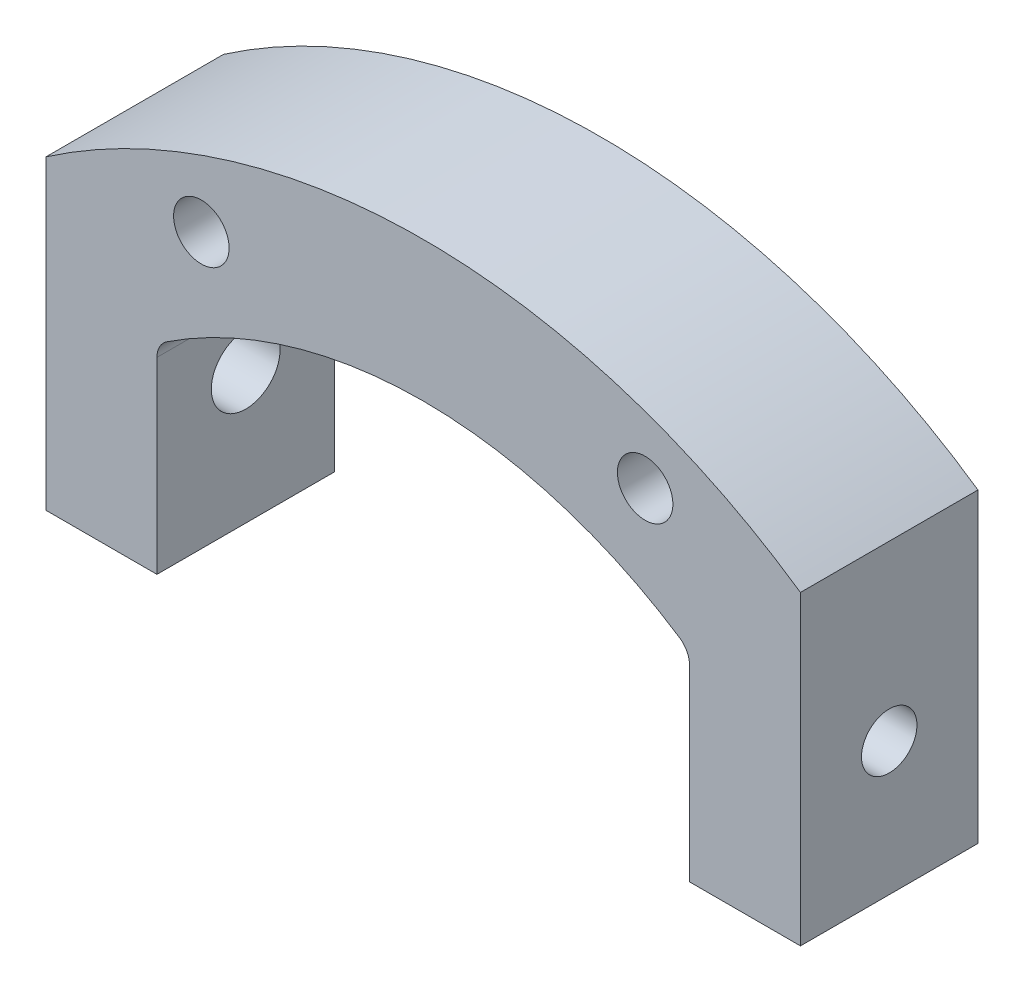
ISO-10303-21;
HEADER;
FILE_DESCRIPTION(('STEP AP214'),'2;1');
FILE_NAME('part.step','',(''),(''),'','','');
FILE_SCHEMA(('AUTOMOTIVE_DESIGN { 1 0 10303 214 1 1 1 1 }'));
ENDSEC;
DATA;
#1=APPLICATION_CONTEXT('core data for automotive mechanical design processes');
#2=APPLICATION_PROTOCOL_DEFINITION('international standard','automotive_design',2000,#1);
#3=PRODUCT_CONTEXT('',#1,'mechanical');
#4=PRODUCT('Part','Part','',(#3));
#5=PRODUCT_RELATED_PRODUCT_CATEGORY('part','',(#4));
#6=PRODUCT_DEFINITION_FORMATION('','',#4);
#7=PRODUCT_DEFINITION_CONTEXT('part definition',#1,'design');
#8=PRODUCT_DEFINITION('design','',#6,#7);
#9=PRODUCT_DEFINITION_SHAPE('','',#8);
#10=(LENGTH_UNIT() NAMED_UNIT(*) SI_UNIT(.MILLI.,.METRE.));
#11=(NAMED_UNIT(*) PLANE_ANGLE_UNIT() SI_UNIT($,.RADIAN.));
#12=(NAMED_UNIT(*) SI_UNIT($,.STERADIAN.) SOLID_ANGLE_UNIT());
#13=UNCERTAINTY_MEASURE_WITH_UNIT(LENGTH_MEASURE(1.E-05),#10,'distance_accuracy_value','');
#14=(GEOMETRIC_REPRESENTATION_CONTEXT(3) GLOBAL_UNCERTAINTY_ASSIGNED_CONTEXT((#13)) GLOBAL_UNIT_ASSIGNED_CONTEXT((#10,
#11,#12)) REPRESENTATION_CONTEXT('',''));
#15=CARTESIAN_POINT('',(0.,0.,0.));
#16=DIRECTION('',(0.,0.,1.));
#17=DIRECTION('',(1.,0.,0.));
#18=AXIS2_PLACEMENT_3D('',#15,#16,#17);
#19=CARTESIAN_POINT('',(-21.5,-5.,8.));
#20=DIRECTION('',(0.,1.,0.));
#21=DIRECTION('',(0.,0.,1.));
#22=AXIS2_PLACEMENT_3D('',#19,#20,#21);
#23=PLANE('',#22);
#24=DIRECTION('',(1.,0.,0.));
#25=VECTOR('',#24,1.);
#26=CARTESIAN_POINT('',(-21.5,-5.,0.));
#27=LINE('',#26,#25);
#28=CARTESIAN_POINT('',(12.,-5.,0.));
#29=VERTEX_POINT('',#28);
#30=CARTESIAN_POINT('',(17.,-5.,0.));
#31=VERTEX_POINT('',#30);
#32=EDGE_CURVE('E154',#29,#31,#27,.T.);
#33=ORIENTED_EDGE('',*,*,#32,.T.);
#34=DIRECTION('',(0.,0.,1.));
#35=VECTOR('',#34,1.);
#36=CARTESIAN_POINT('',(17.,-5.,0.));
#37=LINE('',#36,#35);
#38=CARTESIAN_POINT('',(17.,-5.,8.));
#39=VERTEX_POINT('',#38);
#40=EDGE_CURVE('E137',#31,#39,#37,.T.);
#41=ORIENTED_EDGE('',*,*,#40,.T.);
#42=DIRECTION('',(1.,0.,0.));
#43=VECTOR('',#42,1.);
#44=CARTESIAN_POINT('',(-21.5,-5.,8.));
#45=LINE('',#44,#43);
#46=CARTESIAN_POINT('',(12.,-5.,8.));
#47=VERTEX_POINT('',#46);
#48=EDGE_CURVE('E144',#47,#39,#45,.T.);
#49=ORIENTED_EDGE('',*,*,#48,.F.);
#50=DIRECTION('',(0.,0.,1.));
#51=VECTOR('',#50,1.);
#52=CARTESIAN_POINT('',(12.,-5.,0.));
#53=LINE('',#52,#51);
#54=EDGE_CURVE('E182',#29,#47,#53,.T.);
#55=ORIENTED_EDGE('',*,*,#54,.F.);
#56=EDGE_LOOP('',(#33,#41,#49,#55));
#57=FACE_BOUND('',#56,.T.);
#58=ADVANCED_FACE('F38',(#57),#23,.F.);
#59=CARTESIAN_POINT('',(0.,-15.9224759529077,8.));
#60=DIRECTION('',(0.,0.,-1.));
#61=DIRECTION('',(-1.,0.,0.));
#62=AXIS2_PLACEMENT_3D('',#59,#60,#61);
#63=PLANE('',#62);
#64=ORIENTED_EDGE('',*,*,#48,.T.);
#65=DIRECTION('',(0.,-1.,0.));
#66=VECTOR('',#65,1.);
#67=CARTESIAN_POINT('',(17.,-5.,8.));
#68=LINE('',#67,#66);
#69=CARTESIAN_POINT('',(17.,8.79593823570888,8.));
#70=VERTEX_POINT('',#69);
#71=EDGE_CURVE('E257',#70,#39,#68,.T.);
#72=ORIENTED_EDGE('',*,*,#71,.F.);
#73=CARTESIAN_POINT('',(0.,-15.9224759529077,8.));
#74=DIRECTION('',(0.,0.,1.));
#75=DIRECTION('',(-1.,0.,0.));
#76=AXIS2_PLACEMENT_3D('',#73,#74,#75);
#77=CIRCLE('',#76,30.);
#78=CARTESIAN_POINT('',(-17.,8.79593823570888,8.));
#79=VERTEX_POINT('',#78);
#80=EDGE_CURVE('E136',#70,#79,#77,.T.);
#81=ORIENTED_EDGE('',*,*,#80,.T.);
#82=DIRECTION('',(0.,1.,0.));
#83=VECTOR('',#82,1.);
#84=CARTESIAN_POINT('',(-17.,-5.,8.));
#85=LINE('',#84,#83);
#86=CARTESIAN_POINT('',(-17.,-5.,8.));
#87=VERTEX_POINT('',#86);
#88=EDGE_CURVE('E116',#87,#79,#85,.T.);
#89=ORIENTED_EDGE('',*,*,#88,.F.);
#90=CARTESIAN_POINT('',(-12.,-5.,8.));
#91=VERTEX_POINT('',#90);
#92=EDGE_CURVE('E133',#87,#91,#45,.T.);
#93=ORIENTED_EDGE('',*,*,#92,.T.);
#94=DIRECTION('',(0.,-1.,0.));
#95=VECTOR('',#94,1.);
#96=CARTESIAN_POINT('',(-12.,4.,8.));
#97=LINE('',#96,#95);
#98=CARTESIAN_POINT('',(-12.,3.46960514887598,8.));
#99=VERTEX_POINT('',#98);
#100=EDGE_CURVE('E171',#99,#91,#97,.T.);
#101=ORIENTED_EDGE('',*,*,#100,.F.);
#102=CARTESIAN_POINT('',(-11.,3.46960514887598,8.));
#103=DIRECTION('',(0.,0.,-1.));
#104=DIRECTION('',(-1.,0.,0.));
#105=AXIS2_PLACEMENT_3D('',#102,#103,#104);
#106=CIRCLE('',#105,1.);
#107=CARTESIAN_POINT('',(-11.55,4.30476980330048,8.));
#108=VERTEX_POINT('',#107);
#109=EDGE_CURVE('E46',#99,#108,#106,.T.);
#110=ORIENTED_EDGE('',*,*,#109,.T.);
#111=CARTESIAN_POINT('',(0.,-13.2336879396141,8.));
#112=DIRECTION('',(0.,0.,1.));
#113=DIRECTION('',(-1.,0.,0.));
#114=AXIS2_PLACEMENT_3D('',#111,#112,#113);
#115=CIRCLE('',#114,21.);
#116=CARTESIAN_POINT('',(11.55,4.30476980330048,8.));
#117=VERTEX_POINT('',#116);
#118=EDGE_CURVE('E170',#117,#108,#115,.T.);
#119=ORIENTED_EDGE('',*,*,#118,.F.);
#120=CARTESIAN_POINT('',(11.,3.46960514887598,8.));
#121=DIRECTION('',(0.,0.,-1.));
#122=DIRECTION('',(-1.,0.,0.));
#123=AXIS2_PLACEMENT_3D('',#120,#121,#122);
#124=CIRCLE('',#123,1.);
#125=CARTESIAN_POINT('',(12.,3.46960514887598,8.));
#126=VERTEX_POINT('',#125);
#127=EDGE_CURVE('E165',#117,#126,#124,.T.);
#128=ORIENTED_EDGE('',*,*,#127,.T.);
#129=DIRECTION('',(0.,1.,0.));
#130=VECTOR('',#129,1.);
#131=CARTESIAN_POINT('',(12.,4.,8.));
#132=LINE('',#131,#130);
#133=EDGE_CURVE('E124',#47,#126,#132,.T.);
#134=ORIENTED_EDGE('',*,*,#133,.F.);
#135=EDGE_LOOP('',(#64,#72,#81,#89,#93,#101,#110,#119,#128,#134));
#136=FACE_BOUND('',#135,.T.);
#137=CARTESIAN_POINT('',(-10.,9.36179529455423,8.));
#138=DIRECTION('',(0.,0.,1.));
#139=DIRECTION('',(1.,0.,0.));
#140=AXIS2_PLACEMENT_3D('',#137,#138,#139);
#141=CIRCLE('',#140,1.25);
#142=CARTESIAN_POINT('',(-8.75,9.36179529455423,8.));
#143=VERTEX_POINT('',#142);
#144=EDGE_CURVE('E155',#143,#143,#141,.T.);
#145=ORIENTED_EDGE('',*,*,#144,.F.);
#146=EDGE_LOOP('',(#145));
#147=FACE_BOUND('',#146,.T.);
#148=CARTESIAN_POINT('',(10.,9.36179529455423,8.));
#149=DIRECTION('',(0.,0.,1.));
#150=DIRECTION('',(-1.,0.,0.));
#151=AXIS2_PLACEMENT_3D('',#148,#149,#150);
#152=CIRCLE('',#151,1.25);
#153=CARTESIAN_POINT('',(8.75,9.36179529455423,8.));
#154=VERTEX_POINT('',#153);
#155=EDGE_CURVE('E198',#154,#154,#152,.T.);
#156=ORIENTED_EDGE('',*,*,#155,.F.);
#157=EDGE_LOOP('',(#156));
#158=FACE_BOUND('',#157,.T.);
#159=ADVANCED_FACE('F130',(#136,#147,#158),#63,.F.);
#160=CARTESIAN_POINT('',(0.,-15.9224759529077,0.));
#161=DIRECTION('',(0.,0.,-1.));
#162=DIRECTION('',(-1.,0.,0.));
#163=AXIS2_PLACEMENT_3D('',#160,#161,#162);
#164=PLANE('',#163);
#165=DIRECTION('',(0.,-1.,0.));
#166=VECTOR('',#165,1.);
#167=CARTESIAN_POINT('',(17.,-5.,0.));
#168=LINE('',#167,#166);
#169=CARTESIAN_POINT('',(17.,8.79593823570888,0.));
#170=VERTEX_POINT('',#169);
#171=EDGE_CURVE('E256',#170,#31,#168,.T.);
#172=ORIENTED_EDGE('',*,*,#171,.T.);
#173=ORIENTED_EDGE('',*,*,#32,.F.);
#174=DIRECTION('',(0.,1.,0.));
#175=VECTOR('',#174,1.);
#176=CARTESIAN_POINT('',(12.,4.,0.));
#177=LINE('',#176,#175);
#178=CARTESIAN_POINT('',(12.,3.46960514887598,0.));
#179=VERTEX_POINT('',#178);
#180=EDGE_CURVE('E184',#29,#179,#177,.T.);
#181=ORIENTED_EDGE('',*,*,#180,.T.);
#182=CARTESIAN_POINT('',(11.,3.46960514887598,0.));
#183=DIRECTION('',(0.,0.,-1.));
#184=DIRECTION('',(-1.,0.,0.));
#185=AXIS2_PLACEMENT_3D('',#182,#183,#184);
#186=CIRCLE('',#185,1.);
#187=CARTESIAN_POINT('',(11.55,4.30476980330048,0.));
#188=VERTEX_POINT('',#187);
#189=EDGE_CURVE('E167',#179,#188,#186,.F.);
#190=ORIENTED_EDGE('',*,*,#189,.T.);
#191=CARTESIAN_POINT('',(0.,-13.2336879396141,0.));
#192=DIRECTION('',(0.,0.,1.));
#193=DIRECTION('',(-1.,0.,0.));
#194=AXIS2_PLACEMENT_3D('',#191,#192,#193);
#195=CIRCLE('',#194,21.);
#196=CARTESIAN_POINT('',(-11.55,4.30476980330048,0.));
#197=VERTEX_POINT('',#196);
#198=EDGE_CURVE('E180',#188,#197,#195,.T.);
#199=ORIENTED_EDGE('',*,*,#198,.T.);
#200=CARTESIAN_POINT('',(-11.,3.46960514887598,0.));
#201=DIRECTION('',(0.,0.,-1.));
#202=DIRECTION('',(-1.,0.,0.));
#203=AXIS2_PLACEMENT_3D('',#200,#201,#202);
#204=CIRCLE('',#203,1.);
#205=CARTESIAN_POINT('',(-12.,3.46960514887598,0.));
#206=VERTEX_POINT('',#205);
#207=EDGE_CURVE('E11',#197,#206,#204,.F.);
#208=ORIENTED_EDGE('',*,*,#207,.T.);
#209=DIRECTION('',(0.,-1.,0.));
#210=VECTOR('',#209,1.);
#211=CARTESIAN_POINT('',(-12.,4.,0.));
#212=LINE('',#211,#210);
#213=CARTESIAN_POINT('',(-12.,-5.,0.));
#214=VERTEX_POINT('',#213);
#215=EDGE_CURVE('E179',#206,#214,#212,.T.);
#216=ORIENTED_EDGE('',*,*,#215,.T.);
#217=CARTESIAN_POINT('',(-17.,-5.,0.));
#218=VERTEX_POINT('',#217);
#219=EDGE_CURVE('E157',#218,#214,#27,.T.);
#220=ORIENTED_EDGE('',*,*,#219,.F.);
#221=DIRECTION('',(0.,1.,0.));
#222=VECTOR('',#221,1.);
#223=CARTESIAN_POINT('',(-17.,-5.,0.));
#224=LINE('',#223,#222);
#225=CARTESIAN_POINT('',(-17.,8.79593823570888,0.));
#226=VERTEX_POINT('',#225);
#227=EDGE_CURVE('E119',#218,#226,#224,.T.);
#228=ORIENTED_EDGE('',*,*,#227,.T.);
#229=CARTESIAN_POINT('',(0.,-15.9224759529077,0.));
#230=DIRECTION('',(0.,0.,1.));
#231=DIRECTION('',(-1.,0.,0.));
#232=AXIS2_PLACEMENT_3D('',#229,#230,#231);
#233=CIRCLE('',#232,30.);
#234=EDGE_CURVE('E151',#170,#226,#233,.T.);
#235=ORIENTED_EDGE('',*,*,#234,.F.);
#236=EDGE_LOOP('',(#172,#173,#181,#190,#199,#208,#216,#220,#228,#235));
#237=FACE_BOUND('',#236,.T.);
#238=CARTESIAN_POINT('',(-10.,9.36179529455423,0.));
#239=DIRECTION('',(0.,0.,1.));
#240=DIRECTION('',(1.,0.,0.));
#241=AXIS2_PLACEMENT_3D('',#238,#239,#240);
#242=CIRCLE('',#241,1.25);
#243=CARTESIAN_POINT('',(-8.75,9.36179529455423,0.));
#244=VERTEX_POINT('',#243);
#245=EDGE_CURVE('E201',#244,#244,#242,.T.);
#246=ORIENTED_EDGE('',*,*,#245,.T.);
#247=EDGE_LOOP('',(#246));
#248=FACE_BOUND('',#247,.T.);
#249=CARTESIAN_POINT('',(10.,9.36179529455423,0.));
#250=DIRECTION('',(0.,0.,1.));
#251=DIRECTION('',(-1.,0.,0.));
#252=AXIS2_PLACEMENT_3D('',#249,#250,#251);
#253=CIRCLE('',#252,1.25);
#254=CARTESIAN_POINT('',(8.75,9.36179529455423,0.));
#255=VERTEX_POINT('',#254);
#256=EDGE_CURVE('E197',#255,#255,#253,.T.);
#257=ORIENTED_EDGE('',*,*,#256,.T.);
#258=EDGE_LOOP('',(#257));
#259=FACE_BOUND('',#258,.T.);
#260=ADVANCED_FACE('F208',(#237,#248,#259),#164,.T.);
#261=CARTESIAN_POINT('',(0.,-15.9224759529077,8.));
#262=DIRECTION('',(0.,0.,-1.));
#263=DIRECTION('',(-1.,0.,0.));
#264=AXIS2_PLACEMENT_3D('',#261,#262,#263);
#265=CYLINDRICAL_SURFACE('',#264,30.);
#266=ORIENTED_EDGE('',*,*,#80,.F.);
#267=DIRECTION('',(0.,0.,-1.));
#268=VECTOR('',#267,1.);
#269=CARTESIAN_POINT('',(17.,8.79593823570888,8.));
#270=LINE('',#269,#268);
#271=EDGE_CURVE('E194',#70,#170,#270,.T.);
#272=ORIENTED_EDGE('',*,*,#271,.T.);
#273=ORIENTED_EDGE('',*,*,#234,.T.);
#274=DIRECTION('',(0.,0.,-1.));
#275=VECTOR('',#274,1.);
#276=CARTESIAN_POINT('',(-17.,8.79593823570888,8.));
#277=LINE('',#276,#275);
#278=EDGE_CURVE('E191',#226,#79,#277,.F.);
#279=ORIENTED_EDGE('',*,*,#278,.T.);
#280=EDGE_LOOP('',(#266,#272,#273,#279));
#281=FACE_BOUND('',#280,.T.);
#282=ADVANCED_FACE('F223',(#281),#265,.T.);
#283=ORIENTED_EDGE('',*,*,#92,.F.);
#284=DIRECTION('',(0.,0.,1.));
#285=VECTOR('',#284,1.);
#286=CARTESIAN_POINT('',(-17.,-5.,0.));
#287=LINE('',#286,#285);
#288=EDGE_CURVE('E113',#218,#87,#287,.T.);
#289=ORIENTED_EDGE('',*,*,#288,.F.);
#290=ORIENTED_EDGE('',*,*,#219,.T.);
#291=DIRECTION('',(0.,0.,1.));
#292=VECTOR('',#291,1.);
#293=CARTESIAN_POINT('',(-12.,-5.,0.));
#294=LINE('',#293,#292);
#295=EDGE_CURVE('E142',#214,#91,#294,.T.);
#296=ORIENTED_EDGE('',*,*,#295,.T.);
#297=EDGE_LOOP('',(#283,#289,#290,#296));
#298=FACE_BOUND('',#297,.T.);
#299=ADVANCED_FACE('F140',(#298),#23,.F.);
#300=CARTESIAN_POINT('',(-10.,9.36179529455423,8.));
#301=DIRECTION('',(0.,0.,-1.));
#302=DIRECTION('',(-1.,0.,0.));
#303=AXIS2_PLACEMENT_3D('',#300,#301,#302);
#304=CYLINDRICAL_SURFACE('',#303,1.25);
#305=ORIENTED_EDGE('',*,*,#144,.T.);
#306=EDGE_LOOP('',(#305));
#307=FACE_BOUND('',#306,.T.);
#308=ORIENTED_EDGE('',*,*,#245,.F.);
#309=EDGE_LOOP('',(#308));
#310=FACE_BOUND('',#309,.T.);
#311=ADVANCED_FACE('F211',(#307,#310),#304,.F.);
#312=CARTESIAN_POINT('',(10.,9.36179529455423,8.));
#313=DIRECTION('',(0.,0.,-1.));
#314=DIRECTION('',(-1.,0.,0.));
#315=AXIS2_PLACEMENT_3D('',#312,#313,#314);
#316=CYLINDRICAL_SURFACE('',#315,1.25);
#317=ORIENTED_EDGE('',*,*,#155,.T.);
#318=EDGE_LOOP('',(#317));
#319=FACE_BOUND('',#318,.T.);
#320=ORIENTED_EDGE('',*,*,#256,.F.);
#321=EDGE_LOOP('',(#320));
#322=FACE_BOUND('',#321,.T.);
#323=ADVANCED_FACE('F213',(#319,#322),#316,.F.);
#324=CARTESIAN_POINT('',(12.,4.,0.));
#325=DIRECTION('',(1.,0.,0.));
#326=DIRECTION('',(0.,0.,-1.));
#327=AXIS2_PLACEMENT_3D('',#324,#325,#326);
#328=PLANE('',#327);
#329=CARTESIAN_POINT('',(12.,1.,4.));
#330=DIRECTION('',(1.,0.,0.));
#331=DIRECTION('',(0.,0.,-1.));
#332=AXIS2_PLACEMENT_3D('',#329,#330,#331);
#333=CIRCLE('',#332,1.25);
#334=CARTESIAN_POINT('',(12.,1.,2.75));
#335=VERTEX_POINT('',#334);
#336=EDGE_CURVE('E259',#335,#335,#333,.T.);
#337=ORIENTED_EDGE('',*,*,#336,.T.);
#338=EDGE_LOOP('',(#337));
#339=FACE_BOUND('',#338,.T.);
#340=ORIENTED_EDGE('',*,*,#133,.T.);
#341=DIRECTION('',(0.,0.,-1.));
#342=VECTOR('',#341,1.);
#343=CARTESIAN_POINT('',(12.,3.46960514887598,0.));
#344=LINE('',#343,#342);
#345=EDGE_CURVE('E161',#126,#179,#344,.T.);
#346=ORIENTED_EDGE('',*,*,#345,.T.);
#347=ORIENTED_EDGE('',*,*,#180,.F.);
#348=ORIENTED_EDGE('',*,*,#54,.T.);
#349=EDGE_LOOP('',(#340,#346,#347,#348));
#350=FACE_BOUND('',#349,.T.);
#351=ADVANCED_FACE('F220',(#339,#350),#328,.F.);
#352=CARTESIAN_POINT('',(-12.,4.,0.));
#353=DIRECTION('',(-1.,0.,0.));
#354=DIRECTION('',(0.,0.,1.));
#355=AXIS2_PLACEMENT_3D('',#352,#353,#354);
#356=PLANE('',#355);
#357=CARTESIAN_POINT('',(-12.,1.,4.));
#358=DIRECTION('',(-1.,0.,0.));
#359=DIRECTION('',(0.,0.,1.));
#360=AXIS2_PLACEMENT_3D('',#357,#358,#359);
#361=CIRCLE('',#360,1.55);
#362=CARTESIAN_POINT('',(-12.,1.,5.55));
#363=VERTEX_POINT('',#362);
#364=EDGE_CURVE('E267',#363,#363,#361,.T.);
#365=ORIENTED_EDGE('',*,*,#364,.T.);
#366=EDGE_LOOP('',(#365));
#367=FACE_BOUND('',#366,.T.);
#368=ORIENTED_EDGE('',*,*,#215,.F.);
#369=DIRECTION('',(0.,0.,-1.));
#370=VECTOR('',#369,1.);
#371=CARTESIAN_POINT('',(-12.,3.46960514887598,8.));
#372=LINE('',#371,#370);
#373=EDGE_CURVE('E163',#206,#99,#372,.F.);
#374=ORIENTED_EDGE('',*,*,#373,.T.);
#375=ORIENTED_EDGE('',*,*,#100,.T.);
#376=ORIENTED_EDGE('',*,*,#295,.F.);
#377=EDGE_LOOP('',(#368,#374,#375,#376));
#378=FACE_BOUND('',#377,.T.);
#379=ADVANCED_FACE('F178',(#367,#378),#356,.F.);
#380=CARTESIAN_POINT('',(0.,-13.2336879396141,0.));
#381=DIRECTION('',(0.,0.,1.));
#382=DIRECTION('',(1.,0.,0.));
#383=AXIS2_PLACEMENT_3D('',#380,#381,#382);
#384=CYLINDRICAL_SURFACE('',#383,21.);
#385=ORIENTED_EDGE('',*,*,#198,.F.);
#386=DIRECTION('',(0.,0.,1.));
#387=VECTOR('',#386,1.);
#388=CARTESIAN_POINT('',(11.55,4.30476980330048,0.));
#389=LINE('',#388,#387);
#390=EDGE_CURVE('E146',#188,#117,#389,.T.);
#391=ORIENTED_EDGE('',*,*,#390,.T.);
#392=ORIENTED_EDGE('',*,*,#118,.T.);
#393=DIRECTION('',(0.,0.,1.));
#394=VECTOR('',#393,1.);
#395=CARTESIAN_POINT('',(-11.55,4.30476980330048,0.));
#396=LINE('',#395,#394);
#397=EDGE_CURVE('E143',#108,#197,#396,.F.);
#398=ORIENTED_EDGE('',*,*,#397,.T.);
#399=EDGE_LOOP('',(#385,#391,#392,#398));
#400=FACE_BOUND('',#399,.T.);
#401=ADVANCED_FACE('F174',(#400),#384,.F.);
#402=CARTESIAN_POINT('',(-17.,-5.,0.));
#403=DIRECTION('',(1.,0.,0.));
#404=DIRECTION('',(0.,0.,-1.));
#405=AXIS2_PLACEMENT_3D('',#402,#403,#404);
#406=PLANE('',#405);
#407=CARTESIAN_POINT('',(-17.,1.,4.));
#408=DIRECTION('',(-1.,0.,0.));
#409=DIRECTION('',(0.,0.,1.));
#410=AXIS2_PLACEMENT_3D('',#407,#408,#409);
#411=CIRCLE('',#410,1.55);
#412=CARTESIAN_POINT('',(-17.,1.,5.55));
#413=VERTEX_POINT('',#412);
#414=EDGE_CURVE('E270',#413,#413,#411,.T.);
#415=ORIENTED_EDGE('',*,*,#414,.F.);
#416=EDGE_LOOP('',(#415));
#417=FACE_BOUND('',#416,.T.);
#418=ORIENTED_EDGE('',*,*,#227,.F.);
#419=ORIENTED_EDGE('',*,*,#288,.T.);
#420=ORIENTED_EDGE('',*,*,#88,.T.);
#421=ORIENTED_EDGE('',*,*,#278,.F.);
#422=EDGE_LOOP('',(#418,#419,#420,#421));
#423=FACE_BOUND('',#422,.T.);
#424=ADVANCED_FACE('F115',(#417,#423),#406,.F.);
#425=CARTESIAN_POINT('',(17.,-5.,0.));
#426=DIRECTION('',(-1.,0.,0.));
#427=DIRECTION('',(0.,0.,1.));
#428=AXIS2_PLACEMENT_3D('',#425,#426,#427);
#429=PLANE('',#428);
#430=CARTESIAN_POINT('',(17.,1.,4.));
#431=DIRECTION('',(-1.,0.,0.));
#432=DIRECTION('',(0.,0.,1.));
#433=AXIS2_PLACEMENT_3D('',#430,#431,#432);
#434=CIRCLE('',#433,1.25);
#435=CARTESIAN_POINT('',(17.,1.,5.25));
#436=VERTEX_POINT('',#435);
#437=EDGE_CURVE('E264',#436,#436,#434,.T.);
#438=ORIENTED_EDGE('',*,*,#437,.T.);
#439=EDGE_LOOP('',(#438));
#440=FACE_BOUND('',#439,.T.);
#441=ORIENTED_EDGE('',*,*,#71,.T.);
#442=ORIENTED_EDGE('',*,*,#40,.F.);
#443=ORIENTED_EDGE('',*,*,#171,.F.);
#444=ORIENTED_EDGE('',*,*,#271,.F.);
#445=EDGE_LOOP('',(#441,#442,#443,#444));
#446=FACE_BOUND('',#445,.T.);
#447=ADVANCED_FACE('F276',(#440,#446),#429,.F.);
#448=CARTESIAN_POINT('',(17.,1.,4.));
#449=DIRECTION('',(-1.,0.,0.));
#450=DIRECTION('',(0.,0.,1.));
#451=AXIS2_PLACEMENT_3D('',#448,#449,#450);
#452=CYLINDRICAL_SURFACE('',#451,1.25);
#453=ORIENTED_EDGE('',*,*,#437,.F.);
#454=EDGE_LOOP('',(#453));
#455=FACE_BOUND('',#454,.T.);
#456=ORIENTED_EDGE('',*,*,#336,.F.);
#457=EDGE_LOOP('',(#456));
#458=FACE_BOUND('',#457,.T.);
#459=ADVANCED_FACE('F243',(#455,#458),#452,.F.);
#460=CARTESIAN_POINT('',(-11.,1.,4.));
#461=DIRECTION('',(-1.,0.,0.));
#462=DIRECTION('',(0.,0.,1.));
#463=AXIS2_PLACEMENT_3D('',#460,#461,#462);
#464=CYLINDRICAL_SURFACE('',#463,1.55);
#465=ORIENTED_EDGE('',*,*,#414,.T.);
#466=EDGE_LOOP('',(#465));
#467=FACE_BOUND('',#466,.T.);
#468=ORIENTED_EDGE('',*,*,#364,.F.);
#469=EDGE_LOOP('',(#468));
#470=FACE_BOUND('',#469,.T.);
#471=ADVANCED_FACE('F237',(#467,#470),#464,.F.);
#472=CARTESIAN_POINT('',(11.,3.46960514887598,0.));
#473=DIRECTION('',(0.,0.,1.));
#474=DIRECTION('',(1.,0.,0.));
#475=AXIS2_PLACEMENT_3D('',#472,#473,#474);
#476=CYLINDRICAL_SURFACE('',#475,1.);
#477=ORIENTED_EDGE('',*,*,#189,.F.);
#478=ORIENTED_EDGE('',*,*,#345,.F.);
#479=ORIENTED_EDGE('',*,*,#127,.F.);
#480=ORIENTED_EDGE('',*,*,#390,.F.);
#481=EDGE_LOOP('',(#477,#478,#479,#480));
#482=FACE_BOUND('',#481,.T.);
#483=ADVANCED_FACE('F235',(#482),#476,.F.);
#484=CARTESIAN_POINT('',(-11.,3.46960514887598,0.));
#485=DIRECTION('',(0.,0.,1.));
#486=DIRECTION('',(1.,0.,0.));
#487=AXIS2_PLACEMENT_3D('',#484,#485,#486);
#488=CYLINDRICAL_SURFACE('',#487,1.);
#489=ORIENTED_EDGE('',*,*,#207,.F.);
#490=ORIENTED_EDGE('',*,*,#397,.F.);
#491=ORIENTED_EDGE('',*,*,#109,.F.);
#492=ORIENTED_EDGE('',*,*,#373,.F.);
#493=EDGE_LOOP('',(#489,#490,#491,#492));
#494=FACE_BOUND('',#493,.T.);
#495=ADVANCED_FACE('F40',(#494),#488,.F.);
#496=CLOSED_SHELL('',(#58,#159,#260,#282,#299,#311,#323,#351,#379,#401,#424,#447,#459,#471,#483,#495));
#497=MANIFOLD_SOLID_BREP('B2',#496);
#498=ADVANCED_BREP_SHAPE_REPRESENTATION('',(#18,#497),#14);
#499=SHAPE_DEFINITION_REPRESENTATION(#9,#498);
ENDSEC;
END-ISO-10303-21;
